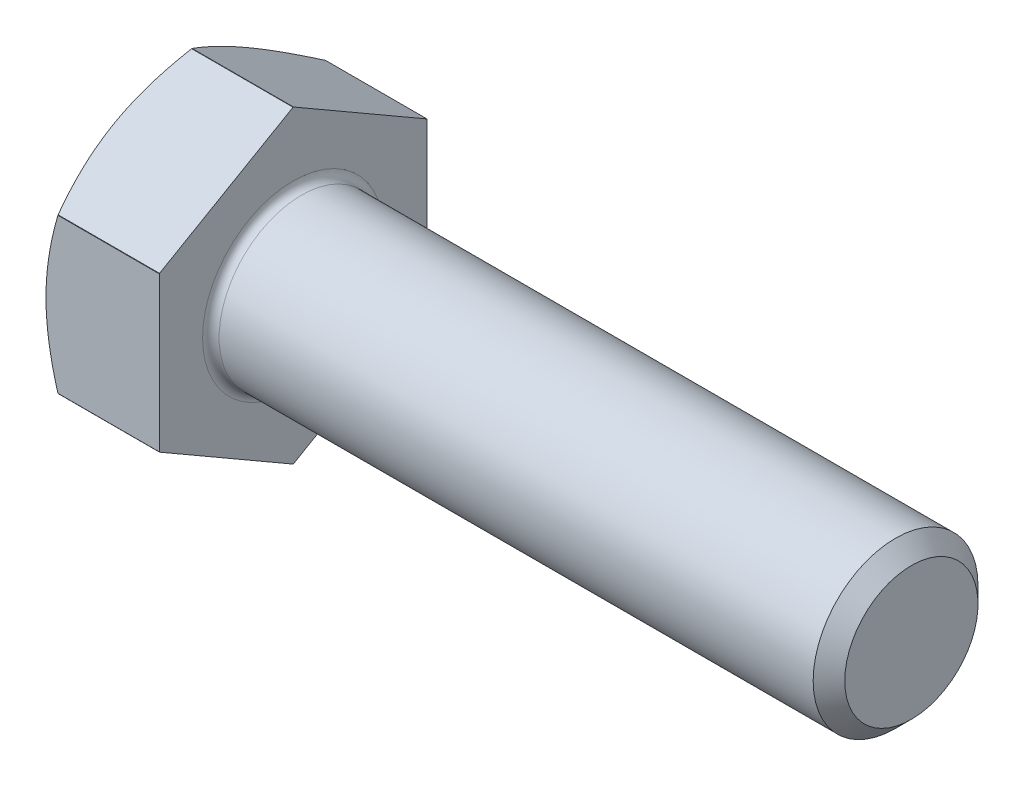
ISO-10303-21;
HEADER;
FILE_DESCRIPTION(('STEP AP214'),'2;1');
FILE_NAME('part.step','',(''),(''),'','','');
FILE_SCHEMA(('AUTOMOTIVE_DESIGN { 1 0 10303 214 1 1 1 1 }'));
ENDSEC;
DATA;
#1=APPLICATION_CONTEXT('core data for automotive mechanical design processes');
#2=APPLICATION_PROTOCOL_DEFINITION('international standard','automotive_design',2000,#1);
#3=PRODUCT_CONTEXT('',#1,'mechanical');
#4=PRODUCT('Part','Part','',(#3));
#5=PRODUCT_RELATED_PRODUCT_CATEGORY('part','',(#4));
#6=PRODUCT_DEFINITION_FORMATION('','',#4);
#7=PRODUCT_DEFINITION_CONTEXT('part definition',#1,'design');
#8=PRODUCT_DEFINITION('design','',#6,#7);
#9=PRODUCT_DEFINITION_SHAPE('','',#8);
#10=(LENGTH_UNIT() NAMED_UNIT(*) SI_UNIT(.MILLI.,.METRE.));
#11=(NAMED_UNIT(*) PLANE_ANGLE_UNIT() SI_UNIT($,.RADIAN.));
#12=(NAMED_UNIT(*) SI_UNIT($,.STERADIAN.) SOLID_ANGLE_UNIT());
#13=UNCERTAINTY_MEASURE_WITH_UNIT(LENGTH_MEASURE(1.E-05),#10,'distance_accuracy_value','');
#14=(GEOMETRIC_REPRESENTATION_CONTEXT(3) GLOBAL_UNCERTAINTY_ASSIGNED_CONTEXT((#13)) GLOBAL_UNIT_ASSIGNED_CONTEXT((#10,
#11,#12)) REPRESENTATION_CONTEXT('',''));
#15=CARTESIAN_POINT('',(0.,0.,0.));
#16=DIRECTION('',(0.,0.,1.));
#17=DIRECTION('',(1.,0.,0.));
#18=AXIS2_PLACEMENT_3D('',#15,#16,#17);
#19=CARTESIAN_POINT('',(-5.5,3.25,0.));
#20=DIRECTION('',(-1.,0.,0.));
#21=DIRECTION('',(0.,0.,1.));
#22=AXIS2_PLACEMENT_3D('',#19,#20,#21);
#23=PLANE('',#22);
#24=CARTESIAN_POINT('',(-5.5,0.,0.));
#25=DIRECTION('',(1.,0.,0.));
#26=DIRECTION('',(0.,0.,-1.));
#27=AXIS2_PLACEMENT_3D('',#24,#25,#26);
#28=CIRCLE('',#27,6.5);
#29=CARTESIAN_POINT('',(-5.5,0.,6.5));
#30=VERTEX_POINT('',#29);
#31=CARTESIAN_POINT('',(-5.5,-5.62916512459885,3.25));
#32=VERTEX_POINT('',#31);
#33=EDGE_CURVE('E436',#30,#32,#28,.T.);
#34=ORIENTED_EDGE('',*,*,#33,.F.);
#35=CARTESIAN_POINT('',(-5.5,0.,0.));
#36=DIRECTION('',(1.,0.,0.));
#37=DIRECTION('',(0.,0.,-1.));
#38=AXIS2_PLACEMENT_3D('',#35,#36,#37);
#39=CIRCLE('',#38,6.5);
#40=CARTESIAN_POINT('',(-5.5,5.62916512459885,3.25));
#41=VERTEX_POINT('',#40);
#42=EDGE_CURVE('E144',#41,#30,#39,.T.);
#43=ORIENTED_EDGE('',*,*,#42,.F.);
#44=CARTESIAN_POINT('',(-5.5,0.,0.));
#45=DIRECTION('',(1.,0.,0.));
#46=DIRECTION('',(0.,0.,-1.));
#47=AXIS2_PLACEMENT_3D('',#44,#45,#46);
#48=CIRCLE('',#47,6.5);
#49=CARTESIAN_POINT('',(-5.5,5.62916512459885,-3.25));
#50=VERTEX_POINT('',#49);
#51=EDGE_CURVE('E438',#50,#41,#48,.T.);
#52=ORIENTED_EDGE('',*,*,#51,.F.);
#53=CARTESIAN_POINT('',(-5.5,0.,0.));
#54=DIRECTION('',(1.,0.,0.));
#55=DIRECTION('',(0.,0.,-1.));
#56=AXIS2_PLACEMENT_3D('',#53,#54,#55);
#57=CIRCLE('',#56,6.5);
#58=CARTESIAN_POINT('',(-5.5,0.,-6.5));
#59=VERTEX_POINT('',#58);
#60=EDGE_CURVE('E453',#59,#50,#57,.T.);
#61=ORIENTED_EDGE('',*,*,#60,.F.);
#62=CARTESIAN_POINT('',(-5.5,0.,0.));
#63=DIRECTION('',(1.,0.,0.));
#64=DIRECTION('',(0.,0.,-1.));
#65=AXIS2_PLACEMENT_3D('',#62,#63,#64);
#66=CIRCLE('',#65,6.5);
#67=CARTESIAN_POINT('',(-5.5,-5.62916512459885,-3.25));
#68=VERTEX_POINT('',#67);
#69=EDGE_CURVE('E456',#68,#59,#66,.T.);
#70=ORIENTED_EDGE('',*,*,#69,.F.);
#71=CARTESIAN_POINT('',(-5.5,0.,0.));
#72=DIRECTION('',(1.,0.,0.));
#73=DIRECTION('',(0.,0.,-1.));
#74=AXIS2_PLACEMENT_3D('',#71,#72,#73);
#75=CIRCLE('',#74,6.5);
#76=EDGE_CURVE('E423',#32,#68,#75,.T.);
#77=ORIENTED_EDGE('',*,*,#76,.F.);
#78=EDGE_LOOP('',(#34,#43,#52,#61,#70,#77));
#79=FACE_BOUND('',#78,.T.);
#80=ADVANCED_FACE('F17',(#79),#23,.T.);
#81=CARTESIAN_POINT('',(-4.92264973081038,0.,0.));
#82=DIRECTION('',(1.,0.,0.));
#83=DIRECTION('',(0.,0.,-1.));
#84=AXIS2_PLACEMENT_3D('',#81,#82,#83);
#85=CONICAL_SURFACE('',#84,7.5,1.0471975511966);
#86=CARTESIAN_POINT('',(-5.5,5.62916512459885,3.25));
#87=CARTESIAN_POINT('',(-5.5000262479628,5.70856394801453,3.11247720378286));
#88=CARTESIAN_POINT('',(-5.49664088946751,5.78795899085982,2.97496095570571));
#89=CARTESIAN_POINT('',(-5.48324202789085,5.94659420864779,2.70019669862719));
#90=CARTESIAN_POINT('',(-5.47322982134487,6.02583441084393,2.56294864242144));
#91=CARTESIAN_POINT('',(-5.44683799273199,6.18365032338789,2.28960346365246));
#92=CARTESIAN_POINT('',(-5.43049029095452,6.26222737844178,2.15350401198999));
#93=CARTESIAN_POINT('',(-5.39177726618552,6.41900910581774,1.88195009447641));
#94=CARTESIAN_POINT('',(-5.36941178751699,6.49721376845293,1.74649564540347));
#95=CARTESIAN_POINT('',(-5.29397560176536,6.73094720624517,1.34165745571959));
#96=CARTESIAN_POINT('',(-5.23252886123201,6.88580034316929,1.07344395485559));
#97=CARTESIAN_POINT('',(-5.09079145170028,7.19417945051687,0.539315672936833));
#98=CARTESIAN_POINT('',(-5.01040706530427,7.34769475014838,0.273419374235897));
#99=CARTESIAN_POINT('',(-4.92264973081038,7.49999381798582,0.00962965079606896));
#100=B_SPLINE_CURVE_WITH_KNOTS('',3,(#86,#87,#88,#89,#90,#91,#92,#93,#94,#95,#96,#97,#98,#99),
.UNSPECIFIED.,.F.,.F.,(4,2,2,2,2,2,4),(0.,0.476344689897625,0.952596211027462,1.42647877933226,
1.90037360793116,2.84693222882254,3.79827733923269),.UNSPECIFIED.);
#101=CARTESIAN_POINT('',(-4.92264973081037,7.49999381798582,0.00962965079606972));
#102=VERTEX_POINT('',#101);
#103=EDGE_CURVE('E278',#41,#102,#100,.T.);
#104=ORIENTED_EDGE('',*,*,#103,.T.);
#105=CARTESIAN_POINT('',(-4.92264973081037,0.,0.));
#106=DIRECTION('',(1.,0.,0.));
#107=DIRECTION('',(0.,0.,-1.));
#108=AXIS2_PLACEMENT_3D('',#105,#106,#107);
#109=CIRCLE('',#108,7.5);
#110=CARTESIAN_POINT('',(-4.92264973081038,7.49999381798582,-0.00962965079606567));
#111=VERTEX_POINT('',#110);
#112=EDGE_CURVE('E145',#111,#102,#109,.T.);
#113=ORIENTED_EDGE('',*,*,#112,.F.);
#114=CARTESIAN_POINT('',(-4.92264973081038,7.49999381798582,-0.00962965079606605));
#115=CARTESIAN_POINT('',(-5.01040706530427,7.34769475014838,-0.273419374235894));
#116=CARTESIAN_POINT('',(-5.09079145170029,7.19417945051687,-0.539315672936831));
#117=CARTESIAN_POINT('',(-5.23252886123201,6.88580034316928,-1.07344395485559));
#118=CARTESIAN_POINT('',(-5.29397560176537,6.73094720624516,-1.34165745571959));
#119=CARTESIAN_POINT('',(-5.36941178751699,6.49721376845293,-1.74649564540347));
#120=CARTESIAN_POINT('',(-5.39177726618553,6.41900910581774,-1.8819500944764));
#121=CARTESIAN_POINT('',(-5.43049029095452,6.26222737844177,-2.15350401198999));
#122=CARTESIAN_POINT('',(-5.44683799273199,6.18365032338788,-2.28960346365246));
#123=CARTESIAN_POINT('',(-5.47322982134488,6.02583441084392,-2.56294864242144));
#124=CARTESIAN_POINT('',(-5.48324202789085,5.94659420864778,-2.70019669862719));
#125=CARTESIAN_POINT('',(-5.49664088946751,5.78795899085981,-2.97496095570571));
#126=CARTESIAN_POINT('',(-5.5000262479628,5.70856394801453,-3.11247720378286));
#127=CARTESIAN_POINT('',(-5.5,5.62916512459885,-3.25));
#128=B_SPLINE_CURVE_WITH_KNOTS('',3,(#114,#115,#116,#117,#118,#119,#120,#121,#122,#123,#124,
#125,#126,#127),.UNSPECIFIED.,.F.,.F.,(4,2,2,2,2,2,4),(0.,0.951345110410157,1.89790373130153,
2.37179855990044,2.84568112820523,3.32193264933507,3.79827733923269),.UNSPECIFIED.);
#129=EDGE_CURVE('E154',#111,#50,#128,.T.);
#130=ORIENTED_EDGE('',*,*,#129,.T.);
#131=ORIENTED_EDGE('',*,*,#51,.T.);
#132=EDGE_LOOP('',(#104,#113,#130,#131));
#133=FACE_BOUND('',#132,.T.);
#134=ADVANCED_FACE('F290',(#133),#85,.T.);
#135=CARTESIAN_POINT('',(-2.46132486540519,0.,0.));
#136=DIRECTION('',(1.,0.,0.));
#137=DIRECTION('',(0.,0.,-1.));
#138=AXIS2_PLACEMENT_3D('',#135,#136,#137);
#139=CYLINDRICAL_SURFACE('',#138,7.5);
#140=DIRECTION('',(1.,0.,0.));
#141=VECTOR('',#140,1.);
#142=CARTESIAN_POINT('',(0.,7.49999381798582,0.00962965079607039));
#143=LINE('',#142,#141);
#144=CARTESIAN_POINT('',(0.,7.49999381798582,0.00962965079607032));
#145=VERTEX_POINT('',#144);
#146=EDGE_CURVE('E139',#102,#145,#143,.T.);
#147=ORIENTED_EDGE('',*,*,#146,.T.);
#148=CARTESIAN_POINT('',(0.,0.,0.));
#149=DIRECTION('',(1.,0.,0.));
#150=DIRECTION('',(0.,0.,-1.));
#151=AXIS2_PLACEMENT_3D('',#148,#149,#150);
#152=CIRCLE('',#151,7.5);
#153=CARTESIAN_POINT('',(0.,7.49999381798582,-0.00962965079606957));
#154=VERTEX_POINT('',#153);
#155=EDGE_CURVE('E132',#145,#154,#152,.F.);
#156=ORIENTED_EDGE('',*,*,#155,.T.);
#157=DIRECTION('',(1.,0.,0.));
#158=VECTOR('',#157,1.);
#159=CARTESIAN_POINT('',(0.,7.49999381798582,-0.00962965079606832));
#160=LINE('',#159,#158);
#161=EDGE_CURVE('E136',#154,#111,#160,.F.);
#162=ORIENTED_EDGE('',*,*,#161,.T.);
#163=ORIENTED_EDGE('',*,*,#112,.T.);
#164=EDGE_LOOP('',(#147,#156,#162,#163));
#165=FACE_BOUND('',#164,.T.);
#166=ADVANCED_FACE('F134',(#165),#139,.T.);
#167=CARTESIAN_POINT('',(-4.92264973081038,0.,0.));
#168=DIRECTION('',(1.,0.,0.));
#169=DIRECTION('',(0.,0.,-1.));
#170=AXIS2_PLACEMENT_3D('',#167,#168,#169);
#171=CONICAL_SURFACE('',#170,7.5,1.0471975511966);
#172=CARTESIAN_POINT('',(-4.92264973081038,3.75833643121188,6.49037034920393));
#173=CARTESIAN_POINT('',(-5.01040706530426,3.91063549904932,6.22658062576411));
#174=CARTESIAN_POINT('',(-5.09079145170028,4.06415079868083,5.96068432706317));
#175=CARTESIAN_POINT('',(-5.23252886123201,4.37252990602842,5.42655604514441));
#176=CARTESIAN_POINT('',(-5.29397560176536,4.52738304295254,5.15834254428042));
#177=CARTESIAN_POINT('',(-5.36941178751699,4.76111648074477,4.75350435459653));
#178=CARTESIAN_POINT('',(-5.39177726618552,4.83932114337996,4.6180499055236));
#179=CARTESIAN_POINT('',(-5.43049029095452,4.99610287075593,4.34649598801001));
#180=CARTESIAN_POINT('',(-5.44683799273199,5.07467992580982,4.21039653634754));
#181=CARTESIAN_POINT('',(-5.47322982134487,5.23249583835377,3.93705135757856));
#182=CARTESIAN_POINT('',(-5.48324202789085,5.31173604054992,3.79980330137281));
#183=CARTESIAN_POINT('',(-5.49664088946751,5.47037125833789,3.52503904429429));
#184=CARTESIAN_POINT('',(-5.5000262479628,5.54976630118317,3.38752279621715));
#185=CARTESIAN_POINT('',(-5.5,5.62916512459885,3.25));
#186=B_SPLINE_CURVE_WITH_KNOTS('',3,(#172,#173,#174,#175,#176,#177,#178,#179,#180,#181,#182,
#183,#184,#185),.UNSPECIFIED.,.F.,.F.,(4,2,2,2,2,2,4),(0.,0.951345110410155,1.89790373130153,
2.37179855990043,2.84568112820523,3.32193264933507,3.79827733923269),.UNSPECIFIED.);
#187=CARTESIAN_POINT('',(-4.92264973081037,3.75833643121188,6.49037034920393));
#188=VERTEX_POINT('',#187);
#189=EDGE_CURVE('E155',#188,#41,#186,.T.);
#190=ORIENTED_EDGE('',*,*,#189,.T.);
#191=ORIENTED_EDGE('',*,*,#42,.T.);
#192=CARTESIAN_POINT('',(-5.5,0.,6.5));
#193=CARTESIAN_POINT('',(-5.5000262479628,0.158797646831358,6.5));
#194=CARTESIAN_POINT('',(-5.49664088946751,0.317587732521928,6.5));
#195=CARTESIAN_POINT('',(-5.48324202789085,0.634858168097874,6.5));
#196=CARTESIAN_POINT('',(-5.47322982134488,0.793338572490156,6.5));
#197=CARTESIAN_POINT('',(-5.44683799273199,1.10897039757807,6.5));
#198=CARTESIAN_POINT('',(-5.43049029095452,1.26612450768585,6.5));
#199=CARTESIAN_POINT('',(-5.39177726618552,1.57968796243778,6.5));
#200=CARTESIAN_POINT('',(-5.36941178751699,1.73609728770817,6.5));
#201=CARTESIAN_POINT('',(-5.29397560176536,2.20356416329262,6.5));
#202=CARTESIAN_POINT('',(-5.23252886123201,2.51327043714086,6.5));
#203=CARTESIAN_POINT('',(-5.09079145170028,3.13002865183604,6.5));
#204=CARTESIAN_POINT('',(-5.01040706530427,3.43705925109906,6.5));
#205=CARTESIAN_POINT('',(-4.92264973081038,3.74165738677394,6.5));
#206=B_SPLINE_CURVE_WITH_KNOTS('',3,(#192,#193,#194,#195,#196,#197,#198,#199,#200,#201,#202,
#203,#204,#205),.UNSPECIFIED.,.F.,.F.,(4,2,2,2,2,2,4),(0.,0.476344689897624,0.952596211027461,
1.42647877933226,1.90037360793116,2.84693222882253,3.79827733923269),.UNSPECIFIED.);
#207=CARTESIAN_POINT('',(-4.92264973081037,3.74165738677394,6.5));
#208=VERTEX_POINT('',#207);
#209=EDGE_CURVE('E248',#30,#208,#206,.T.);
#210=ORIENTED_EDGE('',*,*,#209,.T.);
#211=CARTESIAN_POINT('',(-4.92264973081037,0.,0.));
#212=DIRECTION('',(1.,0.,0.));
#213=DIRECTION('',(0.,0.,-1.));
#214=AXIS2_PLACEMENT_3D('',#211,#212,#213);
#215=CIRCLE('',#214,7.5);
#216=EDGE_CURVE('E434',#188,#208,#215,.T.);
#217=ORIENTED_EDGE('',*,*,#216,.F.);
#218=EDGE_LOOP('',(#190,#191,#210,#217));
#219=FACE_BOUND('',#218,.T.);
#220=ADVANCED_FACE('F502',(#219),#171,.T.);
#221=CARTESIAN_POINT('',(-2.46132486540519,0.,0.));
#222=DIRECTION('',(1.,0.,0.));
#223=DIRECTION('',(0.,0.,-1.));
#224=AXIS2_PLACEMENT_3D('',#221,#222,#223);
#225=CYLINDRICAL_SURFACE('',#224,7.5);
#226=DIRECTION('',(1.,0.,0.));
#227=VECTOR('',#226,1.);
#228=CARTESIAN_POINT('',(0.,3.75833643121188,6.49037034920393));
#229=LINE('',#228,#227);
#230=CARTESIAN_POINT('',(0.,3.75833643121188,6.49037034920393));
#231=VERTEX_POINT('',#230);
#232=EDGE_CURVE('E277',#231,#188,#229,.F.);
#233=ORIENTED_EDGE('',*,*,#232,.T.);
#234=ORIENTED_EDGE('',*,*,#216,.T.);
#235=DIRECTION('',(-1.,0.,0.));
#236=VECTOR('',#235,1.);
#237=CARTESIAN_POINT('',(0.,3.74165738677394,6.5));
#238=LINE('',#237,#236);
#239=CARTESIAN_POINT('',(0.,3.74165738677394,6.5));
#240=VERTEX_POINT('',#239);
#241=EDGE_CURVE('E401',#208,#240,#238,.F.);
#242=ORIENTED_EDGE('',*,*,#241,.T.);
#243=CARTESIAN_POINT('',(0.,0.,0.));
#244=DIRECTION('',(1.,0.,0.));
#245=DIRECTION('',(0.,0.,-1.));
#246=AXIS2_PLACEMENT_3D('',#243,#244,#245);
#247=CIRCLE('',#246,7.5);
#248=EDGE_CURVE('E437',#240,#231,#247,.F.);
#249=ORIENTED_EDGE('',*,*,#248,.T.);
#250=EDGE_LOOP('',(#233,#234,#242,#249));
#251=FACE_BOUND('',#250,.T.);
#252=ADVANCED_FACE('F268',(#251),#225,.T.);
#253=CARTESIAN_POINT('',(-4.92264973081038,0.,0.));
#254=DIRECTION('',(1.,0.,0.));
#255=DIRECTION('',(0.,0.,-1.));
#256=AXIS2_PLACEMENT_3D('',#253,#254,#255);
#257=CONICAL_SURFACE('',#256,7.5,1.0471975511966);
#258=CARTESIAN_POINT('',(-4.92264973081038,-3.74165738677394,6.5));
#259=CARTESIAN_POINT('',(-5.01040706530427,-3.43705925109906,6.5));
#260=CARTESIAN_POINT('',(-5.09079145170028,-3.13002865183604,6.5));
#261=CARTESIAN_POINT('',(-5.23252886123201,-2.51327043714086,6.5));
#262=CARTESIAN_POINT('',(-5.29397560176536,-2.20356416329262,6.5));
#263=CARTESIAN_POINT('',(-5.36941178751699,-1.73609728770817,6.5));
#264=CARTESIAN_POINT('',(-5.39177726618552,-1.57968796243778,6.5));
#265=CARTESIAN_POINT('',(-5.43049029095452,-1.26612450768585,6.5));
#266=CARTESIAN_POINT('',(-5.44683799273199,-1.10897039757807,6.5));
#267=CARTESIAN_POINT('',(-5.47322982134488,-0.793338572490156,6.5));
#268=CARTESIAN_POINT('',(-5.48324202789085,-0.634858168097874,6.5));
#269=CARTESIAN_POINT('',(-5.49664088946751,-0.317587732521928,6.5));
#270=CARTESIAN_POINT('',(-5.5000262479628,-0.158797646831358,6.5));
#271=CARTESIAN_POINT('',(-5.5,0.,6.5));
#272=B_SPLINE_CURVE_WITH_KNOTS('',3,(#258,#259,#260,#261,#262,#263,#264,#265,#266,#267,#268,
#269,#270,#271),.UNSPECIFIED.,.F.,.F.,(4,2,2,2,2,2,4),(0.,0.951345110410156,1.89790373130153,
2.37179855990043,2.84568112820523,3.32193264933506,3.79827733923269),.UNSPECIFIED.);
#273=CARTESIAN_POINT('',(-4.92264973081037,-3.74165738677394,6.5));
#274=VERTEX_POINT('',#273);
#275=EDGE_CURVE('E271',#274,#30,#272,.T.);
#276=ORIENTED_EDGE('',*,*,#275,.T.);
#277=ORIENTED_EDGE('',*,*,#33,.T.);
#278=CARTESIAN_POINT('',(-5.5,-5.62916512459885,3.25));
#279=CARTESIAN_POINT('',(-5.5000262479628,-5.54976630118317,3.38752279621715));
#280=CARTESIAN_POINT('',(-5.49664088946751,-5.47037125833788,3.52503904429429));
#281=CARTESIAN_POINT('',(-5.48324202789085,-5.31173604054991,3.79980330137281));
#282=CARTESIAN_POINT('',(-5.47322982134488,-5.23249583835377,3.93705135757856));
#283=CARTESIAN_POINT('',(-5.44683799273199,-5.07467992580981,4.21039653634754));
#284=CARTESIAN_POINT('',(-5.43049029095452,-4.99610287075592,4.34649598801001));
#285=CARTESIAN_POINT('',(-5.39177726618553,-4.83932114337996,4.61804990552359));
#286=CARTESIAN_POINT('',(-5.36941178751699,-4.76111648074476,4.75350435459653));
#287=CARTESIAN_POINT('',(-5.29397560176537,-4.52738304295254,5.15834254428041));
#288=CARTESIAN_POINT('',(-5.23252886123201,-4.37252990602841,5.42655604514441));
#289=CARTESIAN_POINT('',(-5.09079145170028,-4.06415079868083,5.96068432706317));
#290=CARTESIAN_POINT('',(-5.01040706530427,-3.91063549904932,6.2265806257641));
#291=CARTESIAN_POINT('',(-4.92264973081038,-3.75833643121188,6.49037034920393));
#292=B_SPLINE_CURVE_WITH_KNOTS('',3,(#278,#279,#280,#281,#282,#283,#284,#285,#286,#287,#288,
#289,#290,#291),.UNSPECIFIED.,.F.,.F.,(4,2,2,2,2,2,4),(0.,0.476344689897624,0.952596211027461,
1.42647877933226,1.90037360793116,2.84693222882253,3.79827733923269),.UNSPECIFIED.);
#293=CARTESIAN_POINT('',(-4.92264973081037,-3.75833643121188,6.49037034920393));
#294=VERTEX_POINT('',#293);
#295=EDGE_CURVE('E220',#32,#294,#292,.T.);
#296=ORIENTED_EDGE('',*,*,#295,.T.);
#297=CARTESIAN_POINT('',(-4.92264973081037,0.,0.));
#298=DIRECTION('',(1.,0.,0.));
#299=DIRECTION('',(0.,0.,-1.));
#300=AXIS2_PLACEMENT_3D('',#297,#298,#299);
#301=CIRCLE('',#300,7.5);
#302=EDGE_CURVE('E428',#274,#294,#301,.T.);
#303=ORIENTED_EDGE('',*,*,#302,.F.);
#304=EDGE_LOOP('',(#276,#277,#296,#303));
#305=FACE_BOUND('',#304,.T.);
#306=ADVANCED_FACE('F263',(#305),#257,.T.);
#307=CARTESIAN_POINT('',(-2.46132486540519,0.,0.));
#308=DIRECTION('',(1.,0.,0.));
#309=DIRECTION('',(0.,0.,-1.));
#310=AXIS2_PLACEMENT_3D('',#307,#308,#309);
#311=CYLINDRICAL_SURFACE('',#310,7.5);
#312=DIRECTION('',(-1.,0.,0.));
#313=VECTOR('',#312,1.);
#314=CARTESIAN_POINT('',(0.,-3.74165738677394,6.5));
#315=LINE('',#314,#313);
#316=CARTESIAN_POINT('',(0.,-3.74165738677394,6.5));
#317=VERTEX_POINT('',#316);
#318=EDGE_CURVE('E247',#317,#274,#315,.T.);
#319=ORIENTED_EDGE('',*,*,#318,.T.);
#320=ORIENTED_EDGE('',*,*,#302,.T.);
#321=DIRECTION('',(1.,0.,0.));
#322=VECTOR('',#321,1.);
#323=CARTESIAN_POINT('',(0.,-3.75833643121188,6.49037034920393));
#324=LINE('',#323,#322);
#325=CARTESIAN_POINT('',(0.,-3.75833643121188,6.49037034920393));
#326=VERTEX_POINT('',#325);
#327=EDGE_CURVE('E396',#294,#326,#324,.T.);
#328=ORIENTED_EDGE('',*,*,#327,.T.);
#329=CARTESIAN_POINT('',(0.,0.,0.));
#330=DIRECTION('',(1.,0.,0.));
#331=DIRECTION('',(0.,0.,-1.));
#332=AXIS2_PLACEMENT_3D('',#329,#330,#331);
#333=CIRCLE('',#332,7.5);
#334=EDGE_CURVE('E431',#326,#317,#333,.F.);
#335=ORIENTED_EDGE('',*,*,#334,.T.);
#336=EDGE_LOOP('',(#319,#320,#328,#335));
#337=FACE_BOUND('',#336,.T.);
#338=ADVANCED_FACE('F259',(#337),#311,.T.);
#339=CARTESIAN_POINT('',(-4.92264973081038,0.,0.));
#340=DIRECTION('',(1.,0.,0.));
#341=DIRECTION('',(0.,0.,-1.));
#342=AXIS2_PLACEMENT_3D('',#339,#340,#341);
#343=CONICAL_SURFACE('',#342,7.50000000000001,1.0471975511966);
#344=CARTESIAN_POINT('',(-5.5,-5.62916512459885,-3.25));
#345=CARTESIAN_POINT('',(-5.5000262479628,-5.70856394801453,-3.11247720378286));
#346=CARTESIAN_POINT('',(-5.49664088946751,-5.78795899085982,-2.97496095570571));
#347=CARTESIAN_POINT('',(-5.48324202789085,-5.94659420864779,-2.70019669862719));
#348=CARTESIAN_POINT('',(-5.47322982134488,-6.02583441084393,-2.56294864242144));
#349=CARTESIAN_POINT('',(-5.44683799273199,-6.18365032338789,-2.28960346365246));
#350=CARTESIAN_POINT('',(-5.43049029095452,-6.26222737844178,-2.15350401198999));
#351=CARTESIAN_POINT('',(-5.39177726618552,-6.41900910581774,-1.88195009447641));
#352=CARTESIAN_POINT('',(-5.36941178751699,-6.49721376845293,-1.74649564540347));
#353=CARTESIAN_POINT('',(-5.29397560176536,-6.73094720624516,-1.34165745571959));
#354=CARTESIAN_POINT('',(-5.23252886123201,-6.88580034316929,-1.07344395485559));
#355=CARTESIAN_POINT('',(-5.09079145170028,-7.19417945051687,-0.539315672936834));
#356=CARTESIAN_POINT('',(-5.01040706530426,-7.34769475014838,-0.273419374235897));
#357=CARTESIAN_POINT('',(-4.92264973081038,-7.49999381798582,-0.00962965079606946));
#358=B_SPLINE_CURVE_WITH_KNOTS('',3,(#344,#345,#346,#347,#348,#349,#350,#351,#352,#353,#354,
#355,#356,#357),.UNSPECIFIED.,.F.,.F.,(4,2,2,2,2,2,4),(0.,0.476344689897624,0.952596211027461,
1.42647877933226,1.90037360793116,2.84693222882253,3.79827733923269),.UNSPECIFIED.);
#359=CARTESIAN_POINT('',(-4.92264973081038,-7.49999381798582,-0.00962965079606982));
#360=VERTEX_POINT('',#359);
#361=EDGE_CURVE('E214',#68,#360,#358,.T.);
#362=ORIENTED_EDGE('',*,*,#361,.T.);
#363=CARTESIAN_POINT('',(-4.92264973081038,0.,0.));
#364=DIRECTION('',(1.,0.,0.));
#365=DIRECTION('',(0.,0.,-1.));
#366=AXIS2_PLACEMENT_3D('',#363,#364,#365);
#367=CIRCLE('',#366,7.5);
#368=CARTESIAN_POINT('',(-4.92264973081038,-7.49999381798582,0.00962965079606567));
#369=VERTEX_POINT('',#368);
#370=EDGE_CURVE('E419',#369,#360,#367,.T.);
#371=ORIENTED_EDGE('',*,*,#370,.F.);
#372=CARTESIAN_POINT('',(-4.92264973081038,-7.49999381798582,0.00962965079606724));
#373=CARTESIAN_POINT('',(-5.01040706530427,-7.34769475014838,0.273419374235895));
#374=CARTESIAN_POINT('',(-5.09079145170029,-7.19417945051687,0.539315672936831));
#375=CARTESIAN_POINT('',(-5.23252886123201,-6.88580034316928,1.07344395485559));
#376=CARTESIAN_POINT('',(-5.29397560176537,-6.73094720624516,1.34165745571959));
#377=CARTESIAN_POINT('',(-5.36941178751699,-6.49721376845293,1.74649564540347));
#378=CARTESIAN_POINT('',(-5.39177726618553,-6.41900910581774,1.8819500944764));
#379=CARTESIAN_POINT('',(-5.43049029095452,-6.26222737844177,2.15350401198999));
#380=CARTESIAN_POINT('',(-5.44683799273199,-6.18365032338788,2.28960346365246));
#381=CARTESIAN_POINT('',(-5.47322982134488,-6.02583441084392,2.56294864242144));
#382=CARTESIAN_POINT('',(-5.48324202789085,-5.94659420864778,2.70019669862719));
#383=CARTESIAN_POINT('',(-5.49664088946752,-5.78795899085981,2.97496095570571));
#384=CARTESIAN_POINT('',(-5.5000262479628,-5.70856394801453,3.11247720378286));
#385=CARTESIAN_POINT('',(-5.5,-5.62916512459885,3.25));
#386=B_SPLINE_CURVE_WITH_KNOTS('',3,(#372,#373,#374,#375,#376,#377,#378,#379,#380,#381,#382,
#383,#384,#385),.UNSPECIFIED.,.F.,.F.,(4,2,2,2,2,2,4),(0.,0.951345110410157,1.89790373130153,
2.37179855990043,2.84568112820523,3.32193264933507,3.79827733923269),.UNSPECIFIED.);
#387=EDGE_CURVE('E241',#369,#32,#386,.T.);
#388=ORIENTED_EDGE('',*,*,#387,.T.);
#389=ORIENTED_EDGE('',*,*,#76,.T.);
#390=EDGE_LOOP('',(#362,#371,#388,#389));
#391=FACE_BOUND('',#390,.T.);
#392=ADVANCED_FACE('F254',(#391),#343,.T.);
#393=CARTESIAN_POINT('',(-2.46132486540519,0.,0.));
#394=DIRECTION('',(1.,0.,0.));
#395=DIRECTION('',(0.,0.,-1.));
#396=AXIS2_PLACEMENT_3D('',#393,#394,#395);
#397=CYLINDRICAL_SURFACE('',#396,7.5);
#398=DIRECTION('',(1.,0.,0.));
#399=VECTOR('',#398,1.);
#400=CARTESIAN_POINT('',(0.,-7.49999381798582,-0.00962965079607039));
#401=LINE('',#400,#399);
#402=CARTESIAN_POINT('',(0.,-7.49999381798582,-0.00962965079607039));
#403=VERTEX_POINT('',#402);
#404=EDGE_CURVE('E391',#360,#403,#401,.T.);
#405=ORIENTED_EDGE('',*,*,#404,.T.);
#406=CARTESIAN_POINT('',(0.,0.,0.));
#407=DIRECTION('',(1.,0.,0.));
#408=DIRECTION('',(0.,0.,-1.));
#409=AXIS2_PLACEMENT_3D('',#406,#407,#408);
#410=CIRCLE('',#409,7.5);
#411=CARTESIAN_POINT('',(0.,-7.49999381798582,0.00962965079607044));
#412=VERTEX_POINT('',#411);
#413=EDGE_CURVE('E422',#403,#412,#410,.F.);
#414=ORIENTED_EDGE('',*,*,#413,.T.);
#415=DIRECTION('',(1.,0.,0.));
#416=VECTOR('',#415,1.);
#417=CARTESIAN_POINT('',(0.,-7.49999381798582,0.00962965079606832));
#418=LINE('',#417,#416);
#419=EDGE_CURVE('E215',#412,#369,#418,.F.);
#420=ORIENTED_EDGE('',*,*,#419,.T.);
#421=ORIENTED_EDGE('',*,*,#370,.T.);
#422=EDGE_LOOP('',(#405,#414,#420,#421));
#423=FACE_BOUND('',#422,.T.);
#424=ADVANCED_FACE('F258',(#423),#397,.T.);
#425=CARTESIAN_POINT('',(-4.92264973081038,0.,0.));
#426=DIRECTION('',(1.,0.,0.));
#427=DIRECTION('',(0.,0.,-1.));
#428=AXIS2_PLACEMENT_3D('',#425,#426,#427);
#429=CONICAL_SURFACE('',#428,7.5,1.0471975511966);
#430=CARTESIAN_POINT('',(-4.92264973081038,3.74165738677394,-6.5));
#431=CARTESIAN_POINT('',(-5.01040706530427,3.43705925109906,-6.5));
#432=CARTESIAN_POINT('',(-5.09079145170028,3.13002865183604,-6.5));
#433=CARTESIAN_POINT('',(-5.23252886123201,2.51327043714086,-6.5));
#434=CARTESIAN_POINT('',(-5.29397560176536,2.20356416329262,-6.5));
#435=CARTESIAN_POINT('',(-5.36941178751699,1.73609728770817,-6.5));
#436=CARTESIAN_POINT('',(-5.39177726618552,1.57968796243778,-6.5));
#437=CARTESIAN_POINT('',(-5.43049029095452,1.26612450768585,-6.5));
#438=CARTESIAN_POINT('',(-5.44683799273199,1.10897039757807,-6.5));
#439=CARTESIAN_POINT('',(-5.47322982134488,0.793338572490156,-6.5));
#440=CARTESIAN_POINT('',(-5.48324202789085,0.634858168097874,-6.5));
#441=CARTESIAN_POINT('',(-5.49664088946751,0.317587732521927,-6.5));
#442=CARTESIAN_POINT('',(-5.5000262479628,0.158797646831358,-6.5));
#443=CARTESIAN_POINT('',(-5.5,0.,-6.5));
#444=B_SPLINE_CURVE_WITH_KNOTS('',3,(#430,#431,#432,#433,#434,#435,#436,#437,#438,#439,#440,
#441,#442,#443),.UNSPECIFIED.,.F.,.F.,(4,2,2,2,2,2,4),(0.,0.951345110410156,1.89790373130153,
2.37179855990043,2.84568112820523,3.32193264933507,3.79827733923269),.UNSPECIFIED.);
#445=CARTESIAN_POINT('',(-4.92264973081037,3.74165738677394,-6.5));
#446=VERTEX_POINT('',#445);
#447=EDGE_CURVE('E186',#446,#59,#444,.T.);
#448=ORIENTED_EDGE('',*,*,#447,.T.);
#449=ORIENTED_EDGE('',*,*,#60,.T.);
#450=CARTESIAN_POINT('',(-5.5,5.62916512459885,-3.25));
#451=CARTESIAN_POINT('',(-5.5000262479628,5.54976630118317,-3.38752279621715));
#452=CARTESIAN_POINT('',(-5.49664088946751,5.47037125833788,-3.52503904429429));
#453=CARTESIAN_POINT('',(-5.48324202789085,5.31173604054991,-3.79980330137281));
#454=CARTESIAN_POINT('',(-5.47322982134488,5.23249583835377,-3.93705135757856));
#455=CARTESIAN_POINT('',(-5.44683799273199,5.07467992580981,-4.21039653634754));
#456=CARTESIAN_POINT('',(-5.43049029095452,4.99610287075592,-4.34649598801001));
#457=CARTESIAN_POINT('',(-5.39177726618553,4.83932114337996,-4.61804990552359));
#458=CARTESIAN_POINT('',(-5.36941178751699,4.76111648074476,-4.75350435459653));
#459=CARTESIAN_POINT('',(-5.29397560176537,4.52738304295254,-5.15834254428041));
#460=CARTESIAN_POINT('',(-5.23252886123201,4.37252990602841,-5.42655604514441));
#461=CARTESIAN_POINT('',(-5.09079145170028,4.06415079868083,-5.96068432706317));
#462=CARTESIAN_POINT('',(-5.01040706530427,3.91063549904932,-6.2265806257641));
#463=CARTESIAN_POINT('',(-4.92264973081038,3.75833643121188,-6.49037034920393));
#464=B_SPLINE_CURVE_WITH_KNOTS('',3,(#450,#451,#452,#453,#454,#455,#456,#457,#458,#459,#460,
#461,#462,#463),.UNSPECIFIED.,.F.,.F.,(4,2,2,2,2,2,4),(0.,0.476344689897624,0.952596211027461,
1.42647877933226,1.90037360793116,2.84693222882253,3.79827733923269),.UNSPECIFIED.);
#465=CARTESIAN_POINT('',(-4.92264973081037,3.75833643121188,-6.49037034920393));
#466=VERTEX_POINT('',#465);
#467=EDGE_CURVE('E301',#50,#466,#464,.T.);
#468=ORIENTED_EDGE('',*,*,#467,.T.);
#469=CARTESIAN_POINT('',(-4.92264973081037,0.,0.));
#470=DIRECTION('',(1.,0.,0.));
#471=DIRECTION('',(0.,0.,-1.));
#472=AXIS2_PLACEMENT_3D('',#469,#470,#471);
#473=CIRCLE('',#472,7.5);
#474=EDGE_CURVE('E302',#446,#466,#473,.T.);
#475=ORIENTED_EDGE('',*,*,#474,.F.);
#476=EDGE_LOOP('',(#448,#449,#468,#475));
#477=FACE_BOUND('',#476,.T.);
#478=ADVANCED_FACE('F201',(#477),#429,.T.);
#479=CARTESIAN_POINT('',(-4.92264973081038,0.,0.));
#480=DIRECTION('',(1.,0.,0.));
#481=DIRECTION('',(0.,0.,-1.));
#482=AXIS2_PLACEMENT_3D('',#479,#480,#481);
#483=CONICAL_SURFACE('',#482,7.5,1.0471975511966);
#484=CARTESIAN_POINT('',(-4.92264973081038,-3.75833643121188,-6.49037034920393));
#485=CARTESIAN_POINT('',(-5.01040706530426,-3.91063549904932,-6.22658062576411));
#486=CARTESIAN_POINT('',(-5.09079145170028,-4.06415079868083,-5.96068432706317));
#487=CARTESIAN_POINT('',(-5.23252886123201,-4.37252990602842,-5.42655604514441));
#488=CARTESIAN_POINT('',(-5.29397560176536,-4.52738304295254,-5.15834254428042));
#489=CARTESIAN_POINT('',(-5.36941178751699,-4.76111648074477,-4.75350435459653));
#490=CARTESIAN_POINT('',(-5.39177726618552,-4.83932114337996,-4.6180499055236));
#491=CARTESIAN_POINT('',(-5.43049029095452,-4.99610287075593,-4.34649598801001));
#492=CARTESIAN_POINT('',(-5.44683799273199,-5.07467992580982,-4.21039653634754));
#493=CARTESIAN_POINT('',(-5.47322982134487,-5.23249583835377,-3.93705135757856));
#494=CARTESIAN_POINT('',(-5.48324202789085,-5.31173604054992,-3.79980330137281));
#495=CARTESIAN_POINT('',(-5.49664088946751,-5.47037125833789,-3.52503904429429));
#496=CARTESIAN_POINT('',(-5.5000262479628,-5.54976630118317,-3.38752279621715));
#497=CARTESIAN_POINT('',(-5.5,-5.62916512459885,-3.25));
#498=B_SPLINE_CURVE_WITH_KNOTS('',3,(#484,#485,#486,#487,#488,#489,#490,#491,#492,#493,#494,
#495,#496,#497),.UNSPECIFIED.,.F.,.F.,(4,2,2,2,2,2,4),(0.,0.951345110410155,1.89790373130153,
2.37179855990043,2.84568112820523,3.32193264933507,3.79827733923269),.UNSPECIFIED.);
#499=CARTESIAN_POINT('',(-4.92264973081037,-3.75833643121188,-6.49037034920393));
#500=VERTEX_POINT('',#499);
#501=EDGE_CURVE('E208',#500,#68,#498,.T.);
#502=ORIENTED_EDGE('',*,*,#501,.T.);
#503=ORIENTED_EDGE('',*,*,#69,.T.);
#504=CARTESIAN_POINT('',(-5.5,0.,-6.5));
#505=CARTESIAN_POINT('',(-5.5000262479628,-0.158797646831358,-6.5));
#506=CARTESIAN_POINT('',(-5.49664088946751,-0.317587732521928,-6.5));
#507=CARTESIAN_POINT('',(-5.48324202789085,-0.634858168097875,-6.5));
#508=CARTESIAN_POINT('',(-5.47322982134488,-0.793338572490157,-6.5));
#509=CARTESIAN_POINT('',(-5.44683799273199,-1.10897039757807,-6.5));
#510=CARTESIAN_POINT('',(-5.43049029095452,-1.26612450768585,-6.5));
#511=CARTESIAN_POINT('',(-5.39177726618552,-1.57968796243778,-6.5));
#512=CARTESIAN_POINT('',(-5.36941178751699,-1.73609728770817,-6.5));
#513=CARTESIAN_POINT('',(-5.29397560176536,-2.20356416329263,-6.5));
#514=CARTESIAN_POINT('',(-5.23252886123201,-2.51327043714087,-6.5));
#515=CARTESIAN_POINT('',(-5.09079145170028,-3.13002865183604,-6.5));
#516=CARTESIAN_POINT('',(-5.01040706530427,-3.43705925109906,-6.5));
#517=CARTESIAN_POINT('',(-4.92264973081038,-3.74165738677394,-6.5));
#518=B_SPLINE_CURVE_WITH_KNOTS('',3,(#504,#505,#506,#507,#508,#509,#510,#511,#512,#513,#514,
#515,#516,#517),.UNSPECIFIED.,.F.,.F.,(4,2,2,2,2,2,4),(0.,0.476344689897624,0.952596211027461,
1.42647877933226,1.90037360793116,2.84693222882254,3.79827733923269),.UNSPECIFIED.);
#519=CARTESIAN_POINT('',(-4.92264973081037,-3.74165738677394,-6.5));
#520=VERTEX_POINT('',#519);
#521=EDGE_CURVE('E179',#59,#520,#518,.T.);
#522=ORIENTED_EDGE('',*,*,#521,.T.);
#523=CARTESIAN_POINT('',(-4.92264973081037,0.,0.));
#524=DIRECTION('',(1.,0.,0.));
#525=DIRECTION('',(0.,0.,-1.));
#526=AXIS2_PLACEMENT_3D('',#523,#524,#525);
#527=CIRCLE('',#526,7.5);
#528=EDGE_CURVE('E412',#500,#520,#527,.T.);
#529=ORIENTED_EDGE('',*,*,#528,.F.);
#530=EDGE_LOOP('',(#502,#503,#522,#529));
#531=FACE_BOUND('',#530,.T.);
#532=ADVANCED_FACE('F196',(#531),#483,.T.);
#533=CARTESIAN_POINT('',(-2.46132486540519,0.,0.));
#534=DIRECTION('',(1.,0.,0.));
#535=DIRECTION('',(0.,0.,-1.));
#536=AXIS2_PLACEMENT_3D('',#533,#534,#535);
#537=CYLINDRICAL_SURFACE('',#536,7.5);
#538=DIRECTION('',(1.,0.,0.));
#539=VECTOR('',#538,1.);
#540=CARTESIAN_POINT('',(0.,-3.75833643121188,-6.49037034920393));
#541=LINE('',#540,#539);
#542=CARTESIAN_POINT('',(0.,-3.75833643121188,-6.49037034920393));
#543=VERTEX_POINT('',#542);
#544=EDGE_CURVE('E388',#543,#500,#541,.F.);
#545=ORIENTED_EDGE('',*,*,#544,.T.);
#546=ORIENTED_EDGE('',*,*,#528,.T.);
#547=DIRECTION('',(1.,0.,0.));
#548=VECTOR('',#547,1.);
#549=CARTESIAN_POINT('',(0.,-3.74165738677394,-6.5));
#550=LINE('',#549,#548);
#551=CARTESIAN_POINT('',(0.,-3.74165738677394,-6.5));
#552=VERTEX_POINT('',#551);
#553=EDGE_CURVE('E168',#520,#552,#550,.T.);
#554=ORIENTED_EDGE('',*,*,#553,.T.);
#555=CARTESIAN_POINT('',(0.,0.,0.));
#556=DIRECTION('',(1.,0.,0.));
#557=DIRECTION('',(0.,0.,-1.));
#558=AXIS2_PLACEMENT_3D('',#555,#556,#557);
#559=CIRCLE('',#558,7.5);
#560=EDGE_CURVE('E415',#552,#543,#559,.F.);
#561=ORIENTED_EDGE('',*,*,#560,.T.);
#562=EDGE_LOOP('',(#545,#546,#554,#561));
#563=FACE_BOUND('',#562,.T.);
#564=ADVANCED_FACE('F200',(#563),#537,.T.);
#565=CARTESIAN_POINT('',(-2.46132486540519,0.,0.));
#566=DIRECTION('',(1.,0.,0.));
#567=DIRECTION('',(0.,0.,-1.));
#568=AXIS2_PLACEMENT_3D('',#565,#566,#567);
#569=CYLINDRICAL_SURFACE('',#568,7.5);
#570=DIRECTION('',(1.,0.,0.));
#571=VECTOR('',#570,1.);
#572=CARTESIAN_POINT('',(0.,3.74165738677394,-6.5));
#573=LINE('',#572,#571);
#574=CARTESIAN_POINT('',(0.,3.74165738677394,-6.5));
#575=VERTEX_POINT('',#574);
#576=EDGE_CURVE('E163',#575,#446,#573,.F.);
#577=ORIENTED_EDGE('',*,*,#576,.T.);
#578=ORIENTED_EDGE('',*,*,#474,.T.);
#579=DIRECTION('',(1.,0.,0.));
#580=VECTOR('',#579,1.);
#581=CARTESIAN_POINT('',(0.,3.75833643121188,-6.49037034920393));
#582=LINE('',#581,#580);
#583=CARTESIAN_POINT('',(0.,3.75833643121188,-6.49037034920393));
#584=VERTEX_POINT('',#583);
#585=EDGE_CURVE('E156',#466,#584,#582,.T.);
#586=ORIENTED_EDGE('',*,*,#585,.T.);
#587=CARTESIAN_POINT('',(0.,0.,0.));
#588=DIRECTION('',(1.,0.,0.));
#589=DIRECTION('',(0.,0.,-1.));
#590=AXIS2_PLACEMENT_3D('',#587,#588,#589);
#591=CIRCLE('',#590,7.5);
#592=EDGE_CURVE('E160',#584,#575,#591,.F.);
#593=ORIENTED_EDGE('',*,*,#592,.T.);
#594=EDGE_LOOP('',(#577,#578,#586,#593));
#595=FACE_BOUND('',#594,.T.);
#596=ADVANCED_FACE('F309',(#595),#569,.T.);
#597=CARTESIAN_POINT('',(0.,7.50555349946513,0.));
#598=DIRECTION('',(0.,-0.866025403784439,0.5));
#599=DIRECTION('',(0.,-0.5,-0.866025403784439));
#600=AXIS2_PLACEMENT_3D('',#597,#598,#599);
#601=PLANE('',#600);
#602=DIRECTION('',(0.,0.5,0.866025403784439));
#603=VECTOR('',#602,1.);
#604=CARTESIAN_POINT('',(0.,3.75833643121188,-6.49037034920393));
#605=LINE('',#604,#603);
#606=EDGE_CURVE('E151',#584,#154,#605,.T.);
#607=ORIENTED_EDGE('',*,*,#606,.F.);
#608=ORIENTED_EDGE('',*,*,#585,.F.);
#609=ORIENTED_EDGE('',*,*,#467,.F.);
#610=ORIENTED_EDGE('',*,*,#129,.F.);
#611=ORIENTED_EDGE('',*,*,#161,.F.);
#612=EDGE_LOOP('',(#607,#608,#609,#610,#611));
#613=FACE_BOUND('',#612,.T.);
#614=ADVANCED_FACE('F149',(#613),#601,.F.);
#615=CARTESIAN_POINT('',(0.,3.75277674973257,6.5));
#616=DIRECTION('',(0.,-0.866025403784439,-0.5));
#617=DIRECTION('',(0.,0.5,-0.866025403784439));
#618=AXIS2_PLACEMENT_3D('',#615,#616,#617);
#619=PLANE('',#618);
#620=DIRECTION('',(0.,-0.5,0.866025403784439));
#621=VECTOR('',#620,1.);
#622=CARTESIAN_POINT('',(0.,7.49999381798582,0.00962965079607025));
#623=LINE('',#622,#621);
#624=EDGE_CURVE('E162',#145,#231,#623,.T.);
#625=ORIENTED_EDGE('',*,*,#624,.F.);
#626=ORIENTED_EDGE('',*,*,#146,.F.);
#627=ORIENTED_EDGE('',*,*,#103,.F.);
#628=ORIENTED_EDGE('',*,*,#189,.F.);
#629=ORIENTED_EDGE('',*,*,#232,.F.);
#630=EDGE_LOOP('',(#625,#626,#627,#628,#629));
#631=FACE_BOUND('',#630,.T.);
#632=ADVANCED_FACE('F287',(#631),#619,.F.);
#633=CARTESIAN_POINT('',(0.,-3.75277674973257,6.5));
#634=DIRECTION('',(0.,0.,-1.));
#635=DIRECTION('',(-1.,0.,0.));
#636=AXIS2_PLACEMENT_3D('',#633,#634,#635);
#637=PLANE('',#636);
#638=DIRECTION('',(0.,1.,0.));
#639=VECTOR('',#638,1.);
#640=CARTESIAN_POINT('',(0.,5.95,6.5));
#641=LINE('',#640,#639);
#642=EDGE_CURVE('E165',#240,#317,#641,.F.);
#643=ORIENTED_EDGE('',*,*,#642,.F.);
#644=ORIENTED_EDGE('',*,*,#241,.F.);
#645=ORIENTED_EDGE('',*,*,#209,.F.);
#646=ORIENTED_EDGE('',*,*,#275,.F.);
#647=ORIENTED_EDGE('',*,*,#318,.F.);
#648=EDGE_LOOP('',(#643,#644,#645,#646,#647));
#649=FACE_BOUND('',#648,.T.);
#650=ADVANCED_FACE('F236',(#649),#637,.F.);
#651=CARTESIAN_POINT('',(0.,-7.50555349946513,0.));
#652=DIRECTION('',(0.,0.866025403784439,-0.5));
#653=DIRECTION('',(0.,0.5,0.866025403784439));
#654=AXIS2_PLACEMENT_3D('',#651,#652,#653);
#655=PLANE('',#654);
#656=DIRECTION('',(0.,-0.5,-0.866025403784439));
#657=VECTOR('',#656,1.);
#658=CARTESIAN_POINT('',(0.,-3.75833643121188,6.49037034920393));
#659=LINE('',#658,#657);
#660=EDGE_CURVE('E418',#326,#412,#659,.T.);
#661=ORIENTED_EDGE('',*,*,#660,.F.);
#662=ORIENTED_EDGE('',*,*,#327,.F.);
#663=ORIENTED_EDGE('',*,*,#295,.F.);
#664=ORIENTED_EDGE('',*,*,#387,.F.);
#665=ORIENTED_EDGE('',*,*,#419,.F.);
#666=EDGE_LOOP('',(#661,#662,#663,#664,#665));
#667=FACE_BOUND('',#666,.T.);
#668=ADVANCED_FACE('F230',(#667),#655,.F.);
#669=CARTESIAN_POINT('',(0.,-3.75277674973257,-6.5));
#670=DIRECTION('',(0.,0.866025403784439,0.5));
#671=DIRECTION('',(0.,-0.5,0.866025403784439));
#672=AXIS2_PLACEMENT_3D('',#669,#670,#671);
#673=PLANE('',#672);
#674=DIRECTION('',(0.,0.5,-0.866025403784439));
#675=VECTOR('',#674,1.);
#676=CARTESIAN_POINT('',(0.,-7.49999381798582,-0.00962965079607025));
#677=LINE('',#676,#675);
#678=EDGE_CURVE('E411',#403,#543,#677,.T.);
#679=ORIENTED_EDGE('',*,*,#678,.F.);
#680=ORIENTED_EDGE('',*,*,#404,.F.);
#681=ORIENTED_EDGE('',*,*,#361,.F.);
#682=ORIENTED_EDGE('',*,*,#501,.F.);
#683=ORIENTED_EDGE('',*,*,#544,.F.);
#684=EDGE_LOOP('',(#679,#680,#681,#682,#683));
#685=FACE_BOUND('',#684,.T.);
#686=ADVANCED_FACE('F227',(#685),#673,.F.);
#687=CARTESIAN_POINT('',(0.,3.75277674973257,-6.5));
#688=DIRECTION('',(0.,0.,1.));
#689=DIRECTION('',(1.,0.,0.));
#690=AXIS2_PLACEMENT_3D('',#687,#688,#689);
#691=PLANE('',#690);
#692=DIRECTION('',(0.,1.,0.));
#693=VECTOR('',#692,1.);
#694=CARTESIAN_POINT('',(0.,5.95,-6.5));
#695=LINE('',#694,#693);
#696=EDGE_CURVE('E178',#552,#575,#695,.T.);
#697=ORIENTED_EDGE('',*,*,#696,.F.);
#698=ORIENTED_EDGE('',*,*,#553,.F.);
#699=ORIENTED_EDGE('',*,*,#521,.F.);
#700=ORIENTED_EDGE('',*,*,#447,.F.);
#701=ORIENTED_EDGE('',*,*,#576,.F.);
#702=EDGE_LOOP('',(#697,#698,#699,#700,#701));
#703=FACE_BOUND('',#702,.T.);
#704=ADVANCED_FACE('F192',(#703),#691,.F.);
#705=CARTESIAN_POINT('',(30.,1.6165,0.));
#706=DIRECTION('',(1.,0.,0.));
#707=DIRECTION('',(0.,0.,-1.));
#708=AXIS2_PLACEMENT_3D('',#705,#706,#707);
#709=PLANE('',#708);
#710=CARTESIAN_POINT('',(30.0000000000296,0.,0.));
#711=DIRECTION('',(-1.,0.,0.));
#712=DIRECTION('',(0.,0.,1.));
#713=AXIS2_PLACEMENT_3D('',#710,#711,#712);
#714=CIRCLE('',#713,3.23299999996607);
#715=CARTESIAN_POINT('',(30.0000000000296,0.,3.23299999996607));
#716=VERTEX_POINT('',#715);
#717=EDGE_CURVE('E174',#716,#716,#714,.T.);
#718=ORIENTED_EDGE('',*,*,#717,.F.);
#719=EDGE_LOOP('',(#718));
#720=FACE_BOUND('',#719,.T.);
#721=ADVANCED_FACE('F350',(#720),#709,.T.);
#722=CARTESIAN_POINT('',(0.,5.95,0.));
#723=DIRECTION('',(1.,0.,0.));
#724=DIRECTION('',(0.,0.,-1.));
#725=AXIS2_PLACEMENT_3D('',#722,#723,#724);
#726=PLANE('',#725);
#727=CARTESIAN_POINT('',(0.,0.,0.));
#728=DIRECTION('',(1.,0.,0.));
#729=DIRECTION('',(0.,0.,1.));
#730=AXIS2_PLACEMENT_3D('',#727,#728,#729);
#731=CIRCLE('',#730,4.4);
#732=CARTESIAN_POINT('',(0.,0.,-4.4));
#733=VERTEX_POINT('',#732);
#734=CARTESIAN_POINT('',(0.,0.,4.4));
#735=VERTEX_POINT('',#734);
#736=EDGE_CURVE('E177',#733,#735,#731,.F.);
#737=ORIENTED_EDGE('',*,*,#736,.T.);
#738=CARTESIAN_POINT('',(0.,0.,0.));
#739=DIRECTION('',(1.,0.,0.));
#740=DIRECTION('',(0.,1.,0.));
#741=AXIS2_PLACEMENT_3D('',#738,#739,#740);
#742=CIRCLE('',#741,4.4);
#743=CARTESIAN_POINT('',(0.,4.4,0.));
#744=VERTEX_POINT('',#743);
#745=EDGE_CURVE('E366',#735,#744,#742,.F.);
#746=ORIENTED_EDGE('',*,*,#745,.T.);
#747=CARTESIAN_POINT('',(0.,0.,0.));
#748=DIRECTION('',(1.,0.,0.));
#749=DIRECTION('',(0.,0.,-1.));
#750=AXIS2_PLACEMENT_3D('',#747,#748,#749);
#751=CIRCLE('',#750,4.4);
#752=EDGE_CURVE('E37',#744,#733,#751,.F.);
#753=ORIENTED_EDGE('',*,*,#752,.T.);
#754=EDGE_LOOP('',(#737,#746,#753));
#755=FACE_BOUND('',#754,.T.);
#756=ORIENTED_EDGE('',*,*,#696,.T.);
#757=ORIENTED_EDGE('',*,*,#592,.F.);
#758=ORIENTED_EDGE('',*,*,#606,.T.);
#759=ORIENTED_EDGE('',*,*,#155,.F.);
#760=ORIENTED_EDGE('',*,*,#624,.T.);
#761=ORIENTED_EDGE('',*,*,#248,.F.);
#762=ORIENTED_EDGE('',*,*,#642,.T.);
#763=ORIENTED_EDGE('',*,*,#334,.F.);
#764=ORIENTED_EDGE('',*,*,#660,.T.);
#765=ORIENTED_EDGE('',*,*,#413,.F.);
#766=ORIENTED_EDGE('',*,*,#678,.T.);
#767=ORIENTED_EDGE('',*,*,#560,.F.);
#768=EDGE_LOOP('',(#756,#757,#758,#759,#760,#761,#762,#763,#764,#765,#766,#767));
#769=FACE_BOUND('',#768,.T.);
#770=ADVANCED_FACE('F159',(#755,#769),#726,.T.);
#771=CARTESIAN_POINT('',(29.2329999999765,0.,0.));
#772=DIRECTION('',(-1.,0.,0.));
#773=DIRECTION('',(0.,0.,1.));
#774=AXIS2_PLACEMENT_3D('',#771,#772,#773);
#775=CONICAL_SURFACE('',#774,3.99999999996226,0.785398163360393);
#776=ORIENTED_EDGE('',*,*,#717,.T.);
#777=EDGE_LOOP('',(#776));
#778=FACE_BOUND('',#777,.T.);
#779=CARTESIAN_POINT('',(29.233,0.,0.));
#780=DIRECTION('',(1.,0.,0.));
#781=DIRECTION('',(0.,0.,-1.));
#782=AXIS2_PLACEMENT_3D('',#779,#780,#781);
#783=CIRCLE('',#782,4.);
#784=CARTESIAN_POINT('',(29.233,0.,-4.));
#785=VERTEX_POINT('',#784);
#786=EDGE_CURVE('E28',#785,#785,#783,.F.);
#787=ORIENTED_EDGE('',*,*,#786,.F.);
#788=EDGE_LOOP('',(#787));
#789=FACE_BOUND('',#788,.T.);
#790=ADVANCED_FACE('F326',(#778,#789),#775,.T.);
#791=CARTESIAN_POINT('',(0.4,0.,0.));
#792=DIRECTION('',(-1.,0.,0.));
#793=DIRECTION('',(0.,0.,1.));
#794=AXIS2_PLACEMENT_3D('',#791,#792,#793);
#795=TOROIDAL_SURFACE('',#794,4.4,0.4);
#796=ORIENTED_EDGE('',*,*,#745,.F.);
#797=ORIENTED_EDGE('',*,*,#736,.F.);
#798=ORIENTED_EDGE('',*,*,#752,.F.);
#799=EDGE_LOOP('',(#796,#797,#798));
#800=FACE_BOUND('',#799,.T.);
#801=CARTESIAN_POINT('',(0.399999999999999,0.,0.));
#802=DIRECTION('',(1.,0.,0.));
#803=DIRECTION('',(0.,0.,-1.));
#804=AXIS2_PLACEMENT_3D('',#801,#802,#803);
#805=CIRCLE('',#804,4.);
#806=CARTESIAN_POINT('',(0.399999999999999,0.,-4.));
#807=VERTEX_POINT('',#806);
#808=EDGE_CURVE('E11',#807,#807,#805,.T.);
#809=ORIENTED_EDGE('',*,*,#808,.F.);
#810=EDGE_LOOP('',(#809));
#811=FACE_BOUND('',#810,.T.);
#812=ADVANCED_FACE('F320',(#800,#811),#795,.F.);
#813=CARTESIAN_POINT('',(14.8165,0.,0.));
#814=DIRECTION('',(1.,0.,0.));
#815=DIRECTION('',(0.,0.,-1.));
#816=AXIS2_PLACEMENT_3D('',#813,#814,#815);
#817=CYLINDRICAL_SURFACE('',#816,4.);
#818=ORIENTED_EDGE('',*,*,#786,.T.);
#819=EDGE_LOOP('',(#818));
#820=FACE_BOUND('',#819,.T.);
#821=ORIENTED_EDGE('',*,*,#808,.T.);
#822=EDGE_LOOP('',(#821));
#823=FACE_BOUND('',#822,.T.);
#824=ADVANCED_FACE('F318',(#820,#823),#817,.T.);
#825=CLOSED_SHELL('',(#80,#134,#166,#220,#252,#306,#338,#392,#424,#478,#532,#564,#596,#614,#632,
#650,#668,#686,#704,#721,#770,#790,#812,#824));
#826=MANIFOLD_SOLID_BREP('B1',#825);
#827=ADVANCED_BREP_SHAPE_REPRESENTATION('',(#18,#826),#14);
#828=SHAPE_DEFINITION_REPRESENTATION(#9,#827);
ENDSEC;
END-ISO-10303-21;
